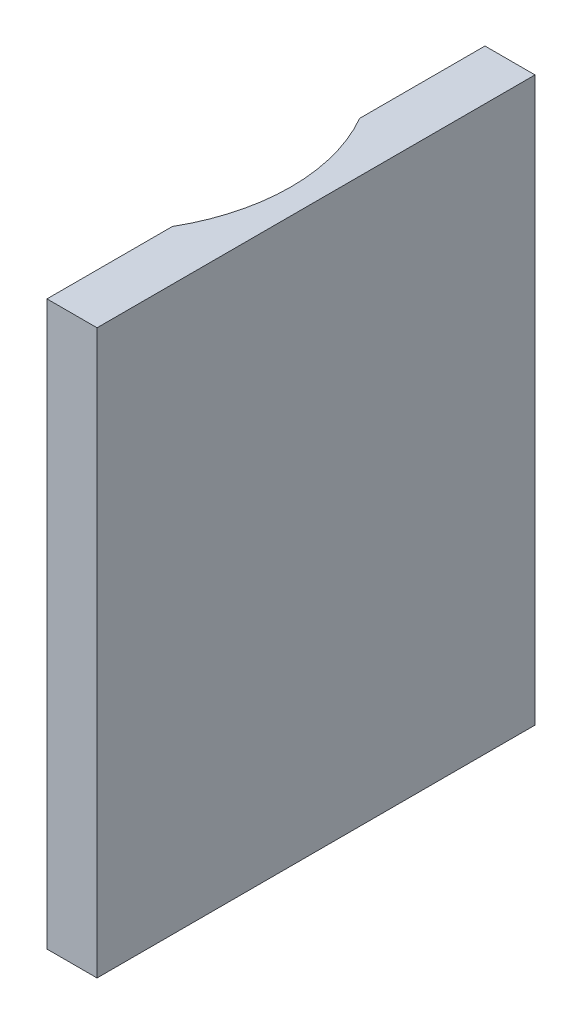
ISO-10303-21;
HEADER;
FILE_DESCRIPTION(('STEP AP214'),'2;1');
FILE_NAME('part.step','',(''),(''),'','','');
FILE_SCHEMA(('AUTOMOTIVE_DESIGN { 1 0 10303 214 1 1 1 1 }'));
ENDSEC;
DATA;
#1=APPLICATION_CONTEXT('core data for automotive mechanical design processes');
#2=APPLICATION_PROTOCOL_DEFINITION('international standard','automotive_design',2000,#1);
#3=PRODUCT_CONTEXT('',#1,'mechanical');
#4=PRODUCT('Part','Part','',(#3));
#5=PRODUCT_RELATED_PRODUCT_CATEGORY('part','',(#4));
#6=PRODUCT_DEFINITION_FORMATION('','',#4);
#7=PRODUCT_DEFINITION_CONTEXT('part definition',#1,'design');
#8=PRODUCT_DEFINITION('design','',#6,#7);
#9=PRODUCT_DEFINITION_SHAPE('','',#8);
#10=(LENGTH_UNIT() NAMED_UNIT(*) SI_UNIT(.MILLI.,.METRE.));
#11=(NAMED_UNIT(*) PLANE_ANGLE_UNIT() SI_UNIT($,.RADIAN.));
#12=(NAMED_UNIT(*) SI_UNIT($,.STERADIAN.) SOLID_ANGLE_UNIT());
#13=UNCERTAINTY_MEASURE_WITH_UNIT(LENGTH_MEASURE(1.E-05),#10,'distance_accuracy_value','');
#14=(GEOMETRIC_REPRESENTATION_CONTEXT(3) GLOBAL_UNCERTAINTY_ASSIGNED_CONTEXT((#13)) GLOBAL_UNIT_ASSIGNED_CONTEXT((#10,
#11,#12)) REPRESENTATION_CONTEXT('',''));
#15=CARTESIAN_POINT('',(0.,0.,0.));
#16=DIRECTION('',(0.,0.,1.));
#17=DIRECTION('',(1.,0.,0.));
#18=AXIS2_PLACEMENT_3D('',#15,#16,#17);
#19=CARTESIAN_POINT('',(17.,45.,-17.5));
#20=DIRECTION('',(-1.,0.,0.));
#21=DIRECTION('',(0.,0.,1.));
#22=AXIS2_PLACEMENT_3D('',#19,#20,#21);
#23=PLANE('',#22);
#24=DIRECTION('',(0.,0.,-1.));
#25=VECTOR('',#24,1.);
#26=CARTESIAN_POINT('',(17.,0.,-17.5));
#27=LINE('',#26,#25);
#28=CARTESIAN_POINT('',(17.,0.,17.5));
#29=VERTEX_POINT('',#28);
#30=CARTESIAN_POINT('',(17.,0.,-17.5));
#31=VERTEX_POINT('',#30);
#32=EDGE_CURVE('E128',#29,#31,#27,.T.);
#33=ORIENTED_EDGE('',*,*,#32,.T.);
#34=DIRECTION('',(0.,-1.,0.));
#35=VECTOR('',#34,1.);
#36=CARTESIAN_POINT('',(17.,45.,-17.5));
#37=LINE('',#36,#35);
#38=CARTESIAN_POINT('',(17.,45.,-17.5));
#39=VERTEX_POINT('',#38);
#40=EDGE_CURVE('E11',#39,#31,#37,.T.);
#41=ORIENTED_EDGE('',*,*,#40,.F.);
#42=DIRECTION('',(0.,0.,-1.));
#43=VECTOR('',#42,1.);
#44=CARTESIAN_POINT('',(17.,45.,-17.5));
#45=LINE('',#44,#43);
#46=CARTESIAN_POINT('',(17.,45.,17.5));
#47=VERTEX_POINT('',#46);
#48=EDGE_CURVE('E144',#47,#39,#45,.T.);
#49=ORIENTED_EDGE('',*,*,#48,.F.);
#50=DIRECTION('',(0.,-1.,0.));
#51=VECTOR('',#50,1.);
#52=CARTESIAN_POINT('',(17.,45.,17.5));
#53=LINE('',#52,#51);
#54=EDGE_CURVE('E124',#47,#29,#53,.T.);
#55=ORIENTED_EDGE('',*,*,#54,.T.);
#56=EDGE_LOOP('',(#33,#41,#49,#55));
#57=FACE_BOUND('',#56,.T.);
#58=ADVANCED_FACE('F39',(#57),#23,.F.);
#59=CARTESIAN_POINT('',(13.,45.,-17.5));
#60=DIRECTION('',(0.,0.,1.));
#61=DIRECTION('',(1.,0.,0.));
#62=AXIS2_PLACEMENT_3D('',#59,#60,#61);
#63=PLANE('',#62);
#64=DIRECTION('',(-1.,0.,0.));
#65=VECTOR('',#64,1.);
#66=CARTESIAN_POINT('',(13.,0.,-17.5));
#67=LINE('',#66,#65);
#68=CARTESIAN_POINT('',(13.,0.,-17.5));
#69=VERTEX_POINT('',#68);
#70=EDGE_CURVE('E132',#31,#69,#67,.T.);
#71=ORIENTED_EDGE('',*,*,#70,.T.);
#72=DIRECTION('',(0.,-1.,0.));
#73=VECTOR('',#72,1.);
#74=CARTESIAN_POINT('',(13.,45.,-17.5));
#75=LINE('',#74,#73);
#76=CARTESIAN_POINT('',(13.,45.,-17.5));
#77=VERTEX_POINT('',#76);
#78=EDGE_CURVE('E48',#77,#69,#75,.T.);
#79=ORIENTED_EDGE('',*,*,#78,.F.);
#80=DIRECTION('',(-1.,0.,0.));
#81=VECTOR('',#80,1.);
#82=CARTESIAN_POINT('',(13.,45.,-17.5));
#83=LINE('',#82,#81);
#84=EDGE_CURVE('E93',#39,#77,#83,.T.);
#85=ORIENTED_EDGE('',*,*,#84,.F.);
#86=ORIENTED_EDGE('',*,*,#40,.T.);
#87=EDGE_LOOP('',(#71,#79,#85,#86));
#88=FACE_BOUND('',#87,.T.);
#89=ADVANCED_FACE('F172',(#88),#63,.F.);
#90=CARTESIAN_POINT('',(13.,45.,-17.5));
#91=DIRECTION('',(1.,0.,0.));
#92=DIRECTION('',(0.,0.,-1.));
#93=AXIS2_PLACEMENT_3D('',#90,#91,#92);
#94=PLANE('',#93);
#95=DIRECTION('',(0.,0.,1.));
#96=VECTOR('',#95,1.);
#97=CARTESIAN_POINT('',(13.,0.,-17.5));
#98=LINE('',#97,#96);
#99=CARTESIAN_POINT('',(13.,0.,-7.48331477354788));
#100=VERTEX_POINT('',#99);
#101=EDGE_CURVE('E135',#69,#100,#98,.T.);
#102=ORIENTED_EDGE('',*,*,#101,.T.);
#103=DIRECTION('',(0.,-1.,0.));
#104=VECTOR('',#103,1.);
#105=CARTESIAN_POINT('',(13.,45.,-7.48331477354788));
#106=LINE('',#105,#104);
#107=CARTESIAN_POINT('',(13.,45.,-7.48331477354788));
#108=VERTEX_POINT('',#107);
#109=EDGE_CURVE('E117',#108,#100,#106,.T.);
#110=ORIENTED_EDGE('',*,*,#109,.F.);
#111=DIRECTION('',(0.,0.,1.));
#112=VECTOR('',#111,1.);
#113=CARTESIAN_POINT('',(13.,45.,-17.5));
#114=LINE('',#113,#112);
#115=EDGE_CURVE('E106',#77,#108,#114,.T.);
#116=ORIENTED_EDGE('',*,*,#115,.F.);
#117=ORIENTED_EDGE('',*,*,#78,.T.);
#118=EDGE_LOOP('',(#102,#110,#116,#117));
#119=FACE_BOUND('',#118,.T.);
#120=ADVANCED_FACE('F154',(#119),#94,.F.);
#121=CARTESIAN_POINT('',(0.,45.,0.));
#122=DIRECTION('',(0.,-1.,0.));
#123=DIRECTION('',(0.,0.,-1.));
#124=AXIS2_PLACEMENT_3D('',#121,#122,#123);
#125=CYLINDRICAL_SURFACE('',#124,15.);
#126=CARTESIAN_POINT('',(0.,0.,0.));
#127=DIRECTION('',(0.,-1.,0.));
#128=DIRECTION('',(0.,0.,1.));
#129=AXIS2_PLACEMENT_3D('',#126,#127,#128);
#130=CIRCLE('',#129,15.);
#131=CARTESIAN_POINT('',(13.,0.,7.48331477354788));
#132=VERTEX_POINT('',#131);
#133=EDGE_CURVE('E115',#100,#132,#130,.T.);
#134=ORIENTED_EDGE('',*,*,#133,.T.);
#135=DIRECTION('',(0.,-1.,0.));
#136=VECTOR('',#135,1.);
#137=CARTESIAN_POINT('',(13.,45.,7.48331477354788));
#138=LINE('',#137,#136);
#139=CARTESIAN_POINT('',(13.,45.,7.48331477354788));
#140=VERTEX_POINT('',#139);
#141=EDGE_CURVE('E112',#140,#132,#138,.T.);
#142=ORIENTED_EDGE('',*,*,#141,.F.);
#143=CARTESIAN_POINT('',(0.,45.,0.));
#144=DIRECTION('',(0.,-1.,0.));
#145=DIRECTION('',(0.,0.,1.));
#146=AXIS2_PLACEMENT_3D('',#143,#144,#145);
#147=CIRCLE('',#146,15.);
#148=EDGE_CURVE('E100',#108,#140,#147,.T.);
#149=ORIENTED_EDGE('',*,*,#148,.F.);
#150=ORIENTED_EDGE('',*,*,#109,.T.);
#151=EDGE_LOOP('',(#134,#142,#149,#150));
#152=FACE_BOUND('',#151,.T.);
#153=ADVANCED_FACE('F113',(#152),#125,.F.);
#154=CARTESIAN_POINT('',(13.,45.,7.48331477354788));
#155=DIRECTION('',(1.,0.,0.));
#156=DIRECTION('',(0.,0.,-1.));
#157=AXIS2_PLACEMENT_3D('',#154,#155,#156);
#158=PLANE('',#157);
#159=DIRECTION('',(0.,0.,1.));
#160=VECTOR('',#159,1.);
#161=CARTESIAN_POINT('',(13.,0.,7.48331477354788));
#162=LINE('',#161,#160);
#163=CARTESIAN_POINT('',(13.,0.,17.5));
#164=VERTEX_POINT('',#163);
#165=EDGE_CURVE('E79',#132,#164,#162,.T.);
#166=ORIENTED_EDGE('',*,*,#165,.T.);
#167=DIRECTION('',(0.,-1.,0.));
#168=VECTOR('',#167,1.);
#169=CARTESIAN_POINT('',(13.,45.,17.5));
#170=LINE('',#169,#168);
#171=CARTESIAN_POINT('',(13.,45.,17.5));
#172=VERTEX_POINT('',#171);
#173=EDGE_CURVE('E118',#172,#164,#170,.T.);
#174=ORIENTED_EDGE('',*,*,#173,.F.);
#175=DIRECTION('',(0.,0.,1.));
#176=VECTOR('',#175,1.);
#177=CARTESIAN_POINT('',(13.,45.,7.48331477354788));
#178=LINE('',#177,#176);
#179=EDGE_CURVE('E104',#140,#172,#178,.T.);
#180=ORIENTED_EDGE('',*,*,#179,.F.);
#181=ORIENTED_EDGE('',*,*,#141,.T.);
#182=EDGE_LOOP('',(#166,#174,#180,#181));
#183=FACE_BOUND('',#182,.T.);
#184=ADVANCED_FACE('F120',(#183),#158,.F.);
#185=CARTESIAN_POINT('',(13.,45.,17.5));
#186=DIRECTION('',(0.,0.,-1.));
#187=DIRECTION('',(-1.,0.,0.));
#188=AXIS2_PLACEMENT_3D('',#185,#186,#187);
#189=PLANE('',#188);
#190=DIRECTION('',(1.,0.,0.));
#191=VECTOR('',#190,1.);
#192=CARTESIAN_POINT('',(13.,0.,17.5));
#193=LINE('',#192,#191);
#194=EDGE_CURVE('E85',#164,#29,#193,.T.);
#195=ORIENTED_EDGE('',*,*,#194,.T.);
#196=ORIENTED_EDGE('',*,*,#54,.F.);
#197=DIRECTION('',(1.,0.,0.));
#198=VECTOR('',#197,1.);
#199=CARTESIAN_POINT('',(13.,45.,17.5));
#200=LINE('',#199,#198);
#201=EDGE_CURVE('E56',#172,#47,#200,.T.);
#202=ORIENTED_EDGE('',*,*,#201,.F.);
#203=ORIENTED_EDGE('',*,*,#173,.T.);
#204=EDGE_LOOP('',(#195,#196,#202,#203));
#205=FACE_BOUND('',#204,.T.);
#206=ADVANCED_FACE('F161',(#205),#189,.F.);
#207=CARTESIAN_POINT('',(0.,45.,0.));
#208=DIRECTION('',(0.,1.,0.));
#209=DIRECTION('',(0.,0.,1.));
#210=AXIS2_PLACEMENT_3D('',#207,#208,#209);
#211=PLANE('',#210);
#212=ORIENTED_EDGE('',*,*,#48,.T.);
#213=ORIENTED_EDGE('',*,*,#84,.T.);
#214=ORIENTED_EDGE('',*,*,#115,.T.);
#215=ORIENTED_EDGE('',*,*,#148,.T.);
#216=ORIENTED_EDGE('',*,*,#179,.T.);
#217=ORIENTED_EDGE('',*,*,#201,.T.);
#218=EDGE_LOOP('',(#212,#213,#214,#215,#216,#217));
#219=FACE_BOUND('',#218,.T.);
#220=ADVANCED_FACE('F102',(#219),#211,.T.);
#221=CARTESIAN_POINT('',(0.,0.,0.));
#222=DIRECTION('',(0.,1.,0.));
#223=DIRECTION('',(0.,0.,1.));
#224=AXIS2_PLACEMENT_3D('',#221,#222,#223);
#225=PLANE('',#224);
#226=ORIENTED_EDGE('',*,*,#32,.F.);
#227=ORIENTED_EDGE('',*,*,#194,.F.);
#228=ORIENTED_EDGE('',*,*,#165,.F.);
#229=ORIENTED_EDGE('',*,*,#133,.F.);
#230=ORIENTED_EDGE('',*,*,#101,.F.);
#231=ORIENTED_EDGE('',*,*,#70,.F.);
#232=EDGE_LOOP('',(#226,#227,#228,#229,#230,#231));
#233=FACE_BOUND('',#232,.T.);
#234=ADVANCED_FACE('F157',(#233),#225,.F.);
#235=CLOSED_SHELL('',(#58,#89,#120,#153,#184,#206,#220,#234));
#236=MANIFOLD_SOLID_BREP('B2',#235);
#237=ADVANCED_BREP_SHAPE_REPRESENTATION('',(#18,#236),#14);
#238=SHAPE_DEFINITION_REPRESENTATION(#9,#237);
ENDSEC;
END-ISO-10303-21;
